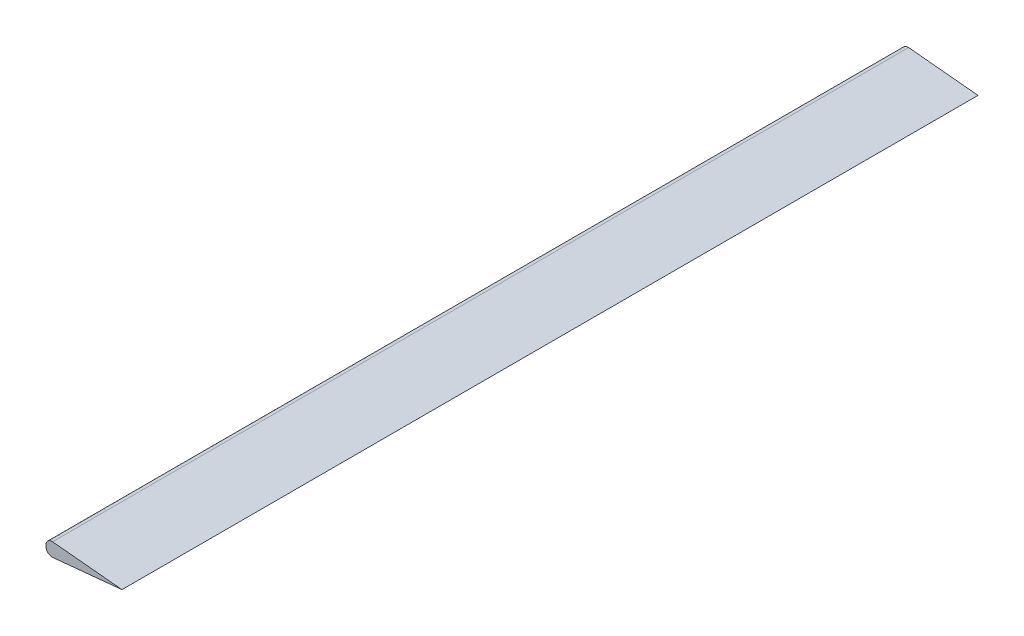
ISO-10303-21;
HEADER;
FILE_DESCRIPTION(('STEP AP214'),'2;1');
FILE_NAME('part.step','',(''),(''),'','','');
FILE_SCHEMA(('AUTOMOTIVE_DESIGN { 1 0 10303 214 1 1 1 1 }'));
ENDSEC;
DATA;
#1=APPLICATION_CONTEXT('core data for automotive mechanical design processes');
#2=APPLICATION_PROTOCOL_DEFINITION('international standard','automotive_design',2000,#1);
#3=PRODUCT_CONTEXT('',#1,'mechanical');
#4=PRODUCT('Part','Part','',(#3));
#5=PRODUCT_RELATED_PRODUCT_CATEGORY('part','',(#4));
#6=PRODUCT_DEFINITION_FORMATION('','',#4);
#7=PRODUCT_DEFINITION_CONTEXT('part definition',#1,'design');
#8=PRODUCT_DEFINITION('design','',#6,#7);
#9=PRODUCT_DEFINITION_SHAPE('','',#8);
#10=(LENGTH_UNIT() NAMED_UNIT(*) SI_UNIT(.MILLI.,.METRE.));
#11=(NAMED_UNIT(*) PLANE_ANGLE_UNIT() SI_UNIT($,.RADIAN.));
#12=(NAMED_UNIT(*) SI_UNIT($,.STERADIAN.) SOLID_ANGLE_UNIT());
#13=UNCERTAINTY_MEASURE_WITH_UNIT(LENGTH_MEASURE(1.E-05),#10,'distance_accuracy_value','');
#14=(GEOMETRIC_REPRESENTATION_CONTEXT(3) GLOBAL_UNCERTAINTY_ASSIGNED_CONTEXT((#13)) GLOBAL_UNIT_ASSIGNED_CONTEXT((#10,
#11,#12)) REPRESENTATION_CONTEXT('',''));
#15=CARTESIAN_POINT('',(0.,0.,0.));
#16=DIRECTION('',(0.,0.,1.));
#17=DIRECTION('',(1.,0.,0.));
#18=AXIS2_PLACEMENT_3D('',#15,#16,#17);
#19=CARTESIAN_POINT('',(48.14824,0.,542.544));
#20=DIRECTION('',(-0.0967948708999717,0.995304351928322,0.));
#21=DIRECTION('',(-0.995304351928322,-0.0967948708999717,0.));
#22=AXIS2_PLACEMENT_3D('',#19,#20,#21);
#23=PLANE('',#22);
#24=DIRECTION('',(0.995304351928322,0.0967948708999717,0.));
#25=VECTOR('',#24,1.);
#26=CARTESIAN_POINT('',(48.14824,0.,542.544));
#27=LINE('',#26,#25);
#28=CARTESIAN_POINT('',(4.17878845812888,-4.27609642949142,542.544));
#29=VERTEX_POINT('',#28);
#30=CARTESIAN_POINT('',(48.14824,0.,542.544));
#31=VERTEX_POINT('',#30);
#32=EDGE_CURVE('E89',#29,#31,#27,.T.);
#33=ORIENTED_EDGE('',*,*,#32,.F.);
#34=DIRECTION('',(0.,0.,-1.));
#35=VECTOR('',#34,1.);
#36=CARTESIAN_POINT('',(4.17878845812889,-4.27609642949142,542.544));
#37=LINE('',#36,#35);
#38=CARTESIAN_POINT('',(4.17878845812888,-4.27609642949142,0.));
#39=VERTEX_POINT('',#38);
#40=EDGE_CURVE('E108',#29,#39,#37,.T.);
#41=ORIENTED_EDGE('',*,*,#40,.T.);
#42=DIRECTION('',(0.995304351928322,0.0967948708999717,0.));
#43=VECTOR('',#42,1.);
#44=CARTESIAN_POINT('',(48.14824,0.,0.));
#45=LINE('',#44,#43);
#46=CARTESIAN_POINT('',(48.14824,0.,0.));
#47=VERTEX_POINT('',#46);
#48=EDGE_CURVE('E106',#39,#47,#45,.T.);
#49=ORIENTED_EDGE('',*,*,#48,.T.);
#50=DIRECTION('',(0.,0.,-1.));
#51=VECTOR('',#50,1.);
#52=CARTESIAN_POINT('',(48.14824,0.,542.544));
#53=LINE('',#52,#51);
#54=EDGE_CURVE('E102',#31,#47,#53,.T.);
#55=ORIENTED_EDGE('',*,*,#54,.F.);
#56=EDGE_LOOP('',(#33,#41,#49,#55));
#57=FACE_BOUND('',#56,.T.);
#58=ADVANCED_FACE('F41',(#57),#23,.F.);
#59=CARTESIAN_POINT('',(0.,4.68249,542.544));
#60=DIRECTION('',(-0.0967948708999717,-0.995304351928322,0.));
#61=DIRECTION('',(0.995304351928322,-0.0967948708999717,0.));
#62=AXIS2_PLACEMENT_3D('',#59,#60,#61);
#63=PLANE('',#62);
#64=DIRECTION('',(-0.995304351928322,0.0967948708999717,0.));
#65=VECTOR('',#64,1.);
#66=CARTESIAN_POINT('',(0.,4.68249,0.));
#67=LINE('',#66,#65);
#68=CARTESIAN_POINT('',(4.17878845812889,4.27609642949142,0.));
#69=VERTEX_POINT('',#68);
#70=EDGE_CURVE('E130',#47,#69,#67,.T.);
#71=ORIENTED_EDGE('',*,*,#70,.T.);
#72=DIRECTION('',(0.,0.,-1.));
#73=VECTOR('',#72,1.);
#74=CARTESIAN_POINT('',(4.17878845812889,4.27609642949142,542.544));
#75=LINE('',#74,#73);
#76=CARTESIAN_POINT('',(4.17878845812889,4.27609642949142,542.544));
#77=VERTEX_POINT('',#76);
#78=EDGE_CURVE('E11',#69,#77,#75,.F.);
#79=ORIENTED_EDGE('',*,*,#78,.T.);
#80=DIRECTION('',(-0.995304351928322,0.0967948708999717,0.));
#81=VECTOR('',#80,1.);
#82=CARTESIAN_POINT('',(0.,4.68249,542.544));
#83=LINE('',#82,#81);
#84=EDGE_CURVE('E91',#31,#77,#83,.T.);
#85=ORIENTED_EDGE('',*,*,#84,.F.);
#86=ORIENTED_EDGE('',*,*,#54,.T.);
#87=EDGE_LOOP('',(#71,#79,#85,#86));
#88=FACE_BOUND('',#87,.T.);
#89=ADVANCED_FACE('F101',(#88),#63,.F.);
#90=CARTESIAN_POINT('',(0.,4.68249,542.544));
#91=DIRECTION('',(1.,0.,0.));
#92=DIRECTION('',(0.,1.,0.));
#93=AXIS2_PLACEMENT_3D('',#90,#91,#92);
#94=PLANE('',#93);
#95=DIRECTION('',(0.,-1.,0.));
#96=VECTOR('',#95,1.);
#97=CARTESIAN_POINT('',(0.,4.68249,0.));
#98=LINE('',#97,#96);
#99=CARTESIAN_POINT('',(0.,0.483986848644513,0.));
#100=VERTEX_POINT('',#99);
#101=CARTESIAN_POINT('',(0.,-0.483986848644515,0.));
#102=VERTEX_POINT('',#101);
#103=EDGE_CURVE('E98',#100,#102,#98,.T.);
#104=ORIENTED_EDGE('',*,*,#103,.T.);
#105=DIRECTION('',(0.,0.,-1.));
#106=VECTOR('',#105,1.);
#107=CARTESIAN_POINT('',(0.,-0.483986848644515,542.544));
#108=LINE('',#107,#106);
#109=CARTESIAN_POINT('',(0.,-0.483986848644515,542.544));
#110=VERTEX_POINT('',#109);
#111=EDGE_CURVE('E62',#102,#110,#108,.F.);
#112=ORIENTED_EDGE('',*,*,#111,.T.);
#113=DIRECTION('',(0.,-1.,0.));
#114=VECTOR('',#113,1.);
#115=CARTESIAN_POINT('',(0.,4.68249,542.544));
#116=LINE('',#115,#114);
#117=CARTESIAN_POINT('',(0.,0.483986848644513,542.544));
#118=VERTEX_POINT('',#117);
#119=EDGE_CURVE('E103',#118,#110,#116,.T.);
#120=ORIENTED_EDGE('',*,*,#119,.F.);
#121=DIRECTION('',(0.,0.,-1.));
#122=VECTOR('',#121,1.);
#123=CARTESIAN_POINT('',(0.,0.483986848644513,542.544));
#124=LINE('',#123,#122);
#125=EDGE_CURVE('E119',#118,#100,#124,.T.);
#126=ORIENTED_EDGE('',*,*,#125,.T.);
#127=EDGE_LOOP('',(#104,#112,#120,#126));
#128=FACE_BOUND('',#127,.T.);
#129=ADVANCED_FACE('F126',(#128),#94,.F.);
#130=CARTESIAN_POINT('',(0.,0.,542.544));
#131=DIRECTION('',(0.,0.,1.));
#132=DIRECTION('',(1.,0.,0.));
#133=AXIS2_PLACEMENT_3D('',#130,#131,#132);
#134=PLANE('',#133);
#135=ORIENTED_EDGE('',*,*,#119,.T.);
#136=CARTESIAN_POINT('',(3.81,-0.483986848644515,542.544));
#137=DIRECTION('',(0.,0.,1.));
#138=DIRECTION('',(1.,0.,0.));
#139=AXIS2_PLACEMENT_3D('',#136,#137,#138);
#140=CIRCLE('',#139,3.81);
#141=EDGE_CURVE('E49',#110,#29,#140,.T.);
#142=ORIENTED_EDGE('',*,*,#141,.T.);
#143=ORIENTED_EDGE('',*,*,#32,.T.);
#144=ORIENTED_EDGE('',*,*,#84,.T.);
#145=CARTESIAN_POINT('',(3.81,0.483986848644514,542.544));
#146=DIRECTION('',(0.,0.,1.));
#147=DIRECTION('',(1.,0.,0.));
#148=AXIS2_PLACEMENT_3D('',#145,#146,#147);
#149=CIRCLE('',#148,3.81);
#150=EDGE_CURVE('E123',#77,#118,#149,.T.);
#151=ORIENTED_EDGE('',*,*,#150,.T.);
#152=EDGE_LOOP('',(#135,#142,#143,#144,#151));
#153=FACE_BOUND('',#152,.T.);
#154=ADVANCED_FACE('F90',(#153),#134,.T.);
#155=CARTESIAN_POINT('',(0.,0.,0.));
#156=DIRECTION('',(0.,0.,1.));
#157=DIRECTION('',(1.,0.,0.));
#158=AXIS2_PLACEMENT_3D('',#155,#156,#157);
#159=PLANE('',#158);
#160=ORIENTED_EDGE('',*,*,#48,.F.);
#161=CARTESIAN_POINT('',(3.81,-0.483986848644515,0.));
#162=DIRECTION('',(0.,0.,1.));
#163=DIRECTION('',(1.,0.,0.));
#164=AXIS2_PLACEMENT_3D('',#161,#162,#163);
#165=CIRCLE('',#164,3.81);
#166=EDGE_CURVE('E117',#39,#102,#165,.F.);
#167=ORIENTED_EDGE('',*,*,#166,.T.);
#168=ORIENTED_EDGE('',*,*,#103,.F.);
#169=CARTESIAN_POINT('',(3.81,0.483986848644514,0.));
#170=DIRECTION('',(0.,0.,1.));
#171=DIRECTION('',(1.,0.,0.));
#172=AXIS2_PLACEMENT_3D('',#169,#170,#171);
#173=CIRCLE('',#172,3.81);
#174=EDGE_CURVE('E110',#100,#69,#173,.F.);
#175=ORIENTED_EDGE('',*,*,#174,.T.);
#176=ORIENTED_EDGE('',*,*,#70,.F.);
#177=EDGE_LOOP('',(#160,#167,#168,#175,#176));
#178=FACE_BOUND('',#177,.T.);
#179=ADVANCED_FACE('F129',(#178),#159,.F.);
#180=CARTESIAN_POINT('',(3.81,-0.483986848644515,542.544));
#181=DIRECTION('',(0.,0.,-1.));
#182=DIRECTION('',(-1.,0.,0.));
#183=AXIS2_PLACEMENT_3D('',#180,#181,#182);
#184=CYLINDRICAL_SURFACE('',#183,3.81);
#185=ORIENTED_EDGE('',*,*,#141,.F.);
#186=ORIENTED_EDGE('',*,*,#111,.F.);
#187=ORIENTED_EDGE('',*,*,#166,.F.);
#188=ORIENTED_EDGE('',*,*,#40,.F.);
#189=EDGE_LOOP('',(#185,#186,#187,#188));
#190=FACE_BOUND('',#189,.T.);
#191=ADVANCED_FACE('F133',(#190),#184,.T.);
#192=CARTESIAN_POINT('',(3.81,0.483986848644514,542.544));
#193=DIRECTION('',(0.,0.,-1.));
#194=DIRECTION('',(-1.,0.,0.));
#195=AXIS2_PLACEMENT_3D('',#192,#193,#194);
#196=CYLINDRICAL_SURFACE('',#195,3.81);
#197=ORIENTED_EDGE('',*,*,#150,.F.);
#198=ORIENTED_EDGE('',*,*,#78,.F.);
#199=ORIENTED_EDGE('',*,*,#174,.F.);
#200=ORIENTED_EDGE('',*,*,#125,.F.);
#201=EDGE_LOOP('',(#197,#198,#199,#200));
#202=FACE_BOUND('',#201,.T.);
#203=ADVANCED_FACE('F43',(#202),#196,.T.);
#204=CLOSED_SHELL('',(#58,#89,#129,#154,#179,#191,#203));
#205=MANIFOLD_SOLID_BREP('B2',#204);
#206=ADVANCED_BREP_SHAPE_REPRESENTATION('',(#18,#205),#14);
#207=SHAPE_DEFINITION_REPRESENTATION(#9,#206);
ENDSEC;
END-ISO-10303-21;
